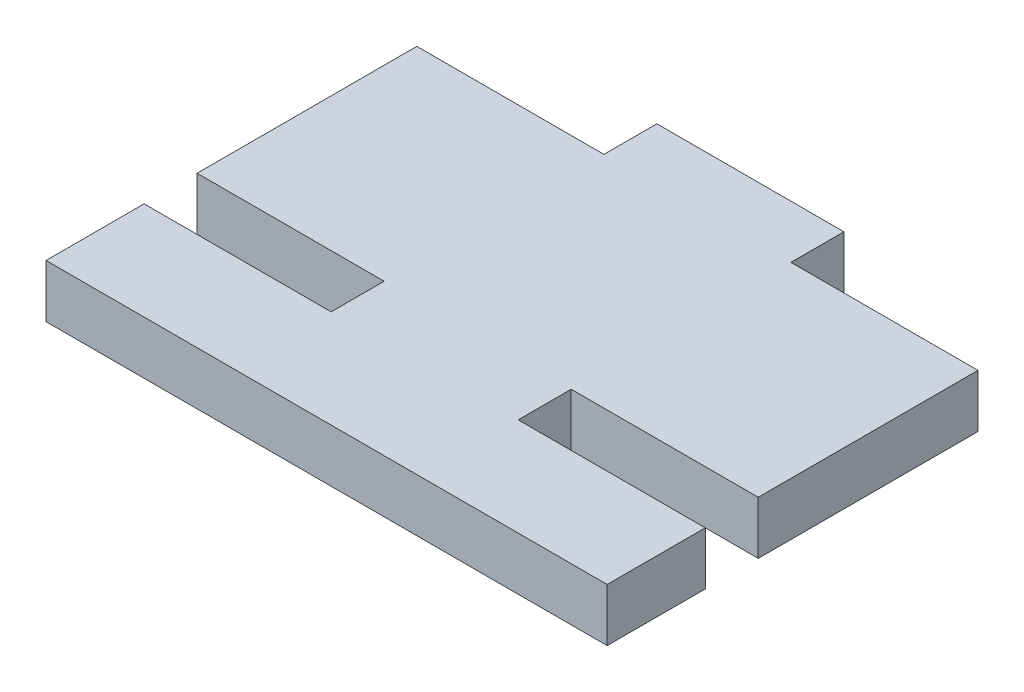
ISO-10303-21;
HEADER;
FILE_DESCRIPTION(('STEP AP214'),'2;1');
FILE_NAME('part.step','',(''),(''),'','','');
FILE_SCHEMA(('AUTOMOTIVE_DESIGN { 1 0 10303 214 1 1 1 1 }'));
ENDSEC;
DATA;
#1=APPLICATION_CONTEXT('core data for automotive mechanical design processes');
#2=APPLICATION_PROTOCOL_DEFINITION('international standard','automotive_design',2000,#1);
#3=PRODUCT_CONTEXT('',#1,'mechanical');
#4=PRODUCT('Part','Part','',(#3));
#5=PRODUCT_RELATED_PRODUCT_CATEGORY('part','',(#4));
#6=PRODUCT_DEFINITION_FORMATION('','',#4);
#7=PRODUCT_DEFINITION_CONTEXT('part definition',#1,'design');
#8=PRODUCT_DEFINITION('design','',#6,#7);
#9=PRODUCT_DEFINITION_SHAPE('','',#8);
#10=(LENGTH_UNIT() NAMED_UNIT(*) SI_UNIT(.MILLI.,.METRE.));
#11=(NAMED_UNIT(*) PLANE_ANGLE_UNIT() SI_UNIT($,.RADIAN.));
#12=(NAMED_UNIT(*) SI_UNIT($,.STERADIAN.) SOLID_ANGLE_UNIT());
#13=UNCERTAINTY_MEASURE_WITH_UNIT(LENGTH_MEASURE(1.E-05),#10,'distance_accuracy_value','');
#14=(GEOMETRIC_REPRESENTATION_CONTEXT(3) GLOBAL_UNCERTAINTY_ASSIGNED_CONTEXT((#13)) GLOBAL_UNIT_ASSIGNED_CONTEXT((#10,
#11,#12)) REPRESENTATION_CONTEXT('',''));
#15=CARTESIAN_POINT('',(0.,0.,0.));
#16=DIRECTION('',(0.,0.,1.));
#17=DIRECTION('',(1.,0.,0.));
#18=AXIS2_PLACEMENT_3D('',#15,#16,#17);
#19=CARTESIAN_POINT('',(14.3,2.7,6.95));
#20=DIRECTION('',(-1.,0.,0.));
#21=DIRECTION('',(0.,0.,1.));
#22=AXIS2_PLACEMENT_3D('',#19,#20,#21);
#23=PLANE('',#22);
#24=DIRECTION('',(0.,0.,-1.));
#25=VECTOR('',#24,1.);
#26=CARTESIAN_POINT('',(14.3,0.,6.95));
#27=LINE('',#26,#25);
#28=CARTESIAN_POINT('',(14.3,0.,11.95));
#29=VERTEX_POINT('',#28);
#30=CARTESIAN_POINT('',(14.3,0.,6.95));
#31=VERTEX_POINT('',#30);
#32=EDGE_CURVE('E177',#29,#31,#27,.T.);
#33=ORIENTED_EDGE('',*,*,#32,.T.);
#34=DIRECTION('',(0.,-1.,0.));
#35=VECTOR('',#34,1.);
#36=CARTESIAN_POINT('',(14.3,2.7,6.95));
#37=LINE('',#36,#35);
#38=CARTESIAN_POINT('',(14.3,2.7,6.95));
#39=VERTEX_POINT('',#38);
#40=EDGE_CURVE('E11',#39,#31,#37,.T.);
#41=ORIENTED_EDGE('',*,*,#40,.F.);
#42=DIRECTION('',(0.,0.,-1.));
#43=VECTOR('',#42,1.);
#44=CARTESIAN_POINT('',(14.3,2.7,6.95));
#45=LINE('',#44,#43);
#46=CARTESIAN_POINT('',(14.3,2.7,11.95));
#47=VERTEX_POINT('',#46);
#48=EDGE_CURVE('E207',#47,#39,#45,.T.);
#49=ORIENTED_EDGE('',*,*,#48,.F.);
#50=DIRECTION('',(0.,-1.,0.));
#51=VECTOR('',#50,1.);
#52=CARTESIAN_POINT('',(14.3,2.7,11.95));
#53=LINE('',#52,#51);
#54=EDGE_CURVE('E173',#47,#29,#53,.T.);
#55=ORIENTED_EDGE('',*,*,#54,.T.);
#56=EDGE_LOOP('',(#33,#41,#49,#55));
#57=FACE_BOUND('',#56,.T.);
#58=ADVANCED_FACE('F33',(#57),#23,.F.);
#59=CARTESIAN_POINT('',(4.76666666666666,2.7,6.95));
#60=DIRECTION('',(0.,0.,1.));
#61=DIRECTION('',(1.,0.,0.));
#62=AXIS2_PLACEMENT_3D('',#59,#60,#61);
#63=PLANE('',#62);
#64=DIRECTION('',(-1.,0.,0.));
#65=VECTOR('',#64,1.);
#66=CARTESIAN_POINT('',(4.76666666666666,0.,6.95));
#67=LINE('',#66,#65);
#68=CARTESIAN_POINT('',(4.76666666666666,0.,6.95));
#69=VERTEX_POINT('',#68);
#70=EDGE_CURVE('E180',#31,#69,#67,.T.);
#71=ORIENTED_EDGE('',*,*,#70,.T.);
#72=DIRECTION('',(0.,-1.,0.));
#73=VECTOR('',#72,1.);
#74=CARTESIAN_POINT('',(4.76666666666666,2.7,6.95));
#75=LINE('',#74,#73);
#76=CARTESIAN_POINT('',(4.76666666666666,2.7,6.95));
#77=VERTEX_POINT('',#76);
#78=EDGE_CURVE('E41',#77,#69,#75,.T.);
#79=ORIENTED_EDGE('',*,*,#78,.F.);
#80=DIRECTION('',(-1.,0.,0.));
#81=VECTOR('',#80,1.);
#82=CARTESIAN_POINT('',(4.76666666666666,2.7,6.95));
#83=LINE('',#82,#81);
#84=EDGE_CURVE('E116',#39,#77,#83,.T.);
#85=ORIENTED_EDGE('',*,*,#84,.F.);
#86=ORIENTED_EDGE('',*,*,#40,.T.);
#87=EDGE_LOOP('',(#71,#79,#85,#86));
#88=FACE_BOUND('',#87,.T.);
#89=ADVANCED_FACE('F305',(#88),#63,.F.);
#90=CARTESIAN_POINT('',(4.76666666666666,2.7,4.25));
#91=DIRECTION('',(-1.,0.,0.));
#92=DIRECTION('',(0.,0.,1.));
#93=AXIS2_PLACEMENT_3D('',#90,#91,#92);
#94=PLANE('',#93);
#95=DIRECTION('',(0.,0.,-1.));
#96=VECTOR('',#95,1.);
#97=CARTESIAN_POINT('',(4.76666666666666,0.,4.25));
#98=LINE('',#97,#96);
#99=CARTESIAN_POINT('',(4.76666666666666,0.,4.25));
#100=VERTEX_POINT('',#99);
#101=EDGE_CURVE('E182',#69,#100,#98,.T.);
#102=ORIENTED_EDGE('',*,*,#101,.T.);
#103=DIRECTION('',(0.,-1.,0.));
#104=VECTOR('',#103,1.);
#105=CARTESIAN_POINT('',(4.76666666666666,2.7,4.25));
#106=LINE('',#105,#104);
#107=CARTESIAN_POINT('',(4.76666666666666,2.7,4.25));
#108=VERTEX_POINT('',#107);
#109=EDGE_CURVE('E238',#108,#100,#106,.T.);
#110=ORIENTED_EDGE('',*,*,#109,.F.);
#111=DIRECTION('',(0.,0.,-1.));
#112=VECTOR('',#111,1.);
#113=CARTESIAN_POINT('',(4.76666666666666,2.7,4.25));
#114=LINE('',#113,#112);
#115=EDGE_CURVE('E246',#77,#108,#114,.T.);
#116=ORIENTED_EDGE('',*,*,#115,.F.);
#117=ORIENTED_EDGE('',*,*,#78,.T.);
#118=EDGE_LOOP('',(#102,#110,#116,#117));
#119=FACE_BOUND('',#118,.T.);
#120=ADVANCED_FACE('F244',(#119),#94,.F.);
#121=CARTESIAN_POINT('',(4.76666666666666,2.7,4.25));
#122=DIRECTION('',(0.,0.,-1.));
#123=DIRECTION('',(-1.,0.,0.));
#124=AXIS2_PLACEMENT_3D('',#121,#122,#123);
#125=PLANE('',#124);
#126=DIRECTION('',(1.,0.,0.));
#127=VECTOR('',#126,1.);
#128=CARTESIAN_POINT('',(4.76666666666666,0.,4.25));
#129=LINE('',#128,#127);
#130=CARTESIAN_POINT('',(14.3,0.,4.25));
#131=VERTEX_POINT('',#130);
#132=EDGE_CURVE('E184',#100,#131,#129,.T.);
#133=ORIENTED_EDGE('',*,*,#132,.T.);
#134=DIRECTION('',(0.,-1.,0.));
#135=VECTOR('',#134,1.);
#136=CARTESIAN_POINT('',(14.3,2.7,4.25));
#137=LINE('',#136,#135);
#138=CARTESIAN_POINT('',(14.3,2.7,4.25));
#139=VERTEX_POINT('',#138);
#140=EDGE_CURVE('E235',#139,#131,#137,.T.);
#141=ORIENTED_EDGE('',*,*,#140,.F.);
#142=DIRECTION('',(1.,0.,0.));
#143=VECTOR('',#142,1.);
#144=CARTESIAN_POINT('',(4.76666666666666,2.7,4.25));
#145=LINE('',#144,#143);
#146=EDGE_CURVE('E264',#108,#139,#145,.T.);
#147=ORIENTED_EDGE('',*,*,#146,.F.);
#148=ORIENTED_EDGE('',*,*,#109,.T.);
#149=EDGE_LOOP('',(#133,#141,#147,#148));
#150=FACE_BOUND('',#149,.T.);
#151=ADVANCED_FACE('F255',(#150),#125,.F.);
#152=CARTESIAN_POINT('',(14.3,2.7,-6.95));
#153=DIRECTION('',(-1.,0.,0.));
#154=DIRECTION('',(0.,0.,1.));
#155=AXIS2_PLACEMENT_3D('',#152,#153,#154);
#156=PLANE('',#155);
#157=DIRECTION('',(0.,0.,-1.));
#158=VECTOR('',#157,1.);
#159=CARTESIAN_POINT('',(14.3,0.,-6.95));
#160=LINE('',#159,#158);
#161=CARTESIAN_POINT('',(14.3,0.,-6.95));
#162=VERTEX_POINT('',#161);
#163=EDGE_CURVE('E186',#131,#162,#160,.T.);
#164=ORIENTED_EDGE('',*,*,#163,.T.);
#165=DIRECTION('',(0.,-1.,0.));
#166=VECTOR('',#165,1.);
#167=CARTESIAN_POINT('',(14.3,2.7,-6.95));
#168=LINE('',#167,#166);
#169=CARTESIAN_POINT('',(14.3,2.7,-6.95));
#170=VERTEX_POINT('',#169);
#171=EDGE_CURVE('E232',#170,#162,#168,.T.);
#172=ORIENTED_EDGE('',*,*,#171,.F.);
#173=DIRECTION('',(0.,0.,-1.));
#174=VECTOR('',#173,1.);
#175=CARTESIAN_POINT('',(14.3,2.7,-6.95));
#176=LINE('',#175,#174);
#177=EDGE_CURVE('E261',#139,#170,#176,.T.);
#178=ORIENTED_EDGE('',*,*,#177,.F.);
#179=ORIENTED_EDGE('',*,*,#140,.T.);
#180=EDGE_LOOP('',(#164,#172,#178,#179));
#181=FACE_BOUND('',#180,.T.);
#182=ADVANCED_FACE('F259',(#181),#156,.F.);
#183=CARTESIAN_POINT('',(4.76666666666666,2.7,-6.95));
#184=DIRECTION('',(0.,0.,1.));
#185=DIRECTION('',(1.,0.,0.));
#186=AXIS2_PLACEMENT_3D('',#183,#184,#185);
#187=PLANE('',#186);
#188=DIRECTION('',(-1.,0.,0.));
#189=VECTOR('',#188,1.);
#190=CARTESIAN_POINT('',(4.76666666666666,0.,-6.95));
#191=LINE('',#190,#189);
#192=CARTESIAN_POINT('',(4.76666666666666,0.,-6.95));
#193=VERTEX_POINT('',#192);
#194=EDGE_CURVE('E188',#162,#193,#191,.T.);
#195=ORIENTED_EDGE('',*,*,#194,.T.);
#196=DIRECTION('',(0.,-1.,0.));
#197=VECTOR('',#196,1.);
#198=CARTESIAN_POINT('',(4.76666666666666,2.7,-6.95));
#199=LINE('',#198,#197);
#200=CARTESIAN_POINT('',(4.76666666666666,2.7,-6.95));
#201=VERTEX_POINT('',#200);
#202=EDGE_CURVE('E229',#201,#193,#199,.T.);
#203=ORIENTED_EDGE('',*,*,#202,.F.);
#204=DIRECTION('',(-1.,0.,0.));
#205=VECTOR('',#204,1.);
#206=CARTESIAN_POINT('',(4.76666666666666,2.7,-6.95));
#207=LINE('',#206,#205);
#208=EDGE_CURVE('E263',#170,#201,#207,.T.);
#209=ORIENTED_EDGE('',*,*,#208,.F.);
#210=ORIENTED_EDGE('',*,*,#171,.T.);
#211=EDGE_LOOP('',(#195,#203,#209,#210));
#212=FACE_BOUND('',#211,.T.);
#213=ADVANCED_FACE('F318',(#212),#187,.F.);
#214=CARTESIAN_POINT('',(4.76666666666666,2.7,-6.95));
#215=DIRECTION('',(-1.,0.,0.));
#216=DIRECTION('',(0.,0.,1.));
#217=AXIS2_PLACEMENT_3D('',#214,#215,#216);
#218=PLANE('',#217);
#219=DIRECTION('',(0.,0.,-1.));
#220=VECTOR('',#219,1.);
#221=CARTESIAN_POINT('',(4.76666666666666,0.,-6.95));
#222=LINE('',#221,#220);
#223=CARTESIAN_POINT('',(4.76666666666666,0.,-9.65));
#224=VERTEX_POINT('',#223);
#225=EDGE_CURVE('E190',#193,#224,#222,.T.);
#226=ORIENTED_EDGE('',*,*,#225,.T.);
#227=DIRECTION('',(0.,-1.,0.));
#228=VECTOR('',#227,1.);
#229=CARTESIAN_POINT('',(4.76666666666666,2.7,-9.65));
#230=LINE('',#229,#228);
#231=CARTESIAN_POINT('',(4.76666666666666,2.7,-9.65));
#232=VERTEX_POINT('',#231);
#233=EDGE_CURVE('E226',#232,#224,#230,.T.);
#234=ORIENTED_EDGE('',*,*,#233,.F.);
#235=DIRECTION('',(0.,0.,-1.));
#236=VECTOR('',#235,1.);
#237=CARTESIAN_POINT('',(4.76666666666666,2.7,-6.95));
#238=LINE('',#237,#236);
#239=EDGE_CURVE('E266',#201,#232,#238,.T.);
#240=ORIENTED_EDGE('',*,*,#239,.F.);
#241=ORIENTED_EDGE('',*,*,#202,.T.);
#242=EDGE_LOOP('',(#226,#234,#240,#241));
#243=FACE_BOUND('',#242,.T.);
#244=ADVANCED_FACE('F321',(#243),#218,.F.);
#245=CARTESIAN_POINT('',(-4.76666666666667,2.7,-9.65));
#246=DIRECTION('',(0.,0.,1.));
#247=DIRECTION('',(1.,0.,0.));
#248=AXIS2_PLACEMENT_3D('',#245,#246,#247);
#249=PLANE('',#248);
#250=DIRECTION('',(-1.,0.,0.));
#251=VECTOR('',#250,1.);
#252=CARTESIAN_POINT('',(-4.76666666666667,0.,-9.65));
#253=LINE('',#252,#251);
#254=CARTESIAN_POINT('',(-4.76666666666667,0.,-9.65));
#255=VERTEX_POINT('',#254);
#256=EDGE_CURVE('E192',#224,#255,#253,.T.);
#257=ORIENTED_EDGE('',*,*,#256,.T.);
#258=DIRECTION('',(0.,-1.,0.));
#259=VECTOR('',#258,1.);
#260=CARTESIAN_POINT('',(-4.76666666666667,2.7,-9.65));
#261=LINE('',#260,#259);
#262=CARTESIAN_POINT('',(-4.76666666666667,2.7,-9.65));
#263=VERTEX_POINT('',#262);
#264=EDGE_CURVE('E223',#263,#255,#261,.T.);
#265=ORIENTED_EDGE('',*,*,#264,.F.);
#266=DIRECTION('',(-1.,0.,0.));
#267=VECTOR('',#266,1.);
#268=CARTESIAN_POINT('',(-4.76666666666667,2.7,-9.65));
#269=LINE('',#268,#267);
#270=EDGE_CURVE('E272',#232,#263,#269,.T.);
#271=ORIENTED_EDGE('',*,*,#270,.F.);
#272=ORIENTED_EDGE('',*,*,#233,.T.);
#273=EDGE_LOOP('',(#257,#265,#271,#272));
#274=FACE_BOUND('',#273,.T.);
#275=ADVANCED_FACE('F325',(#274),#249,.F.);
#276=CARTESIAN_POINT('',(-4.76666666666667,2.7,-6.95));
#277=DIRECTION('',(1.,0.,0.));
#278=DIRECTION('',(0.,0.,-1.));
#279=AXIS2_PLACEMENT_3D('',#276,#277,#278);
#280=PLANE('',#279);
#281=DIRECTION('',(0.,0.,1.));
#282=VECTOR('',#281,1.);
#283=CARTESIAN_POINT('',(-4.76666666666667,0.,-6.95));
#284=LINE('',#283,#282);
#285=CARTESIAN_POINT('',(-4.76666666666667,0.,-6.95));
#286=VERTEX_POINT('',#285);
#287=EDGE_CURVE('E194',#255,#286,#284,.T.);
#288=ORIENTED_EDGE('',*,*,#287,.T.);
#289=DIRECTION('',(0.,-1.,0.));
#290=VECTOR('',#289,1.);
#291=CARTESIAN_POINT('',(-4.76666666666667,2.7,-6.95));
#292=LINE('',#291,#290);
#293=CARTESIAN_POINT('',(-4.76666666666667,2.7,-6.95));
#294=VERTEX_POINT('',#293);
#295=EDGE_CURVE('E220',#294,#286,#292,.T.);
#296=ORIENTED_EDGE('',*,*,#295,.F.);
#297=DIRECTION('',(0.,0.,1.));
#298=VECTOR('',#297,1.);
#299=CARTESIAN_POINT('',(-4.76666666666667,2.7,-6.95));
#300=LINE('',#299,#298);
#301=EDGE_CURVE('E274',#263,#294,#300,.T.);
#302=ORIENTED_EDGE('',*,*,#301,.F.);
#303=ORIENTED_EDGE('',*,*,#264,.T.);
#304=EDGE_LOOP('',(#288,#296,#302,#303));
#305=FACE_BOUND('',#304,.T.);
#306=ADVANCED_FACE('F329',(#305),#280,.F.);
#307=CARTESIAN_POINT('',(-14.3,2.7,-6.95));
#308=DIRECTION('',(0.,0.,1.));
#309=DIRECTION('',(1.,0.,0.));
#310=AXIS2_PLACEMENT_3D('',#307,#308,#309);
#311=PLANE('',#310);
#312=DIRECTION('',(-1.,0.,0.));
#313=VECTOR('',#312,1.);
#314=CARTESIAN_POINT('',(-14.3,0.,-6.95));
#315=LINE('',#314,#313);
#316=CARTESIAN_POINT('',(-14.3,0.,-6.95));
#317=VERTEX_POINT('',#316);
#318=EDGE_CURVE('E196',#286,#317,#315,.T.);
#319=ORIENTED_EDGE('',*,*,#318,.T.);
#320=DIRECTION('',(0.,-1.,0.));
#321=VECTOR('',#320,1.);
#322=CARTESIAN_POINT('',(-14.3,2.7,-6.95));
#323=LINE('',#322,#321);
#324=CARTESIAN_POINT('',(-14.3,2.7,-6.95));
#325=VERTEX_POINT('',#324);
#326=EDGE_CURVE('E217',#325,#317,#323,.T.);
#327=ORIENTED_EDGE('',*,*,#326,.F.);
#328=DIRECTION('',(-1.,0.,0.));
#329=VECTOR('',#328,1.);
#330=CARTESIAN_POINT('',(-14.3,2.7,-6.95));
#331=LINE('',#330,#329);
#332=EDGE_CURVE('E276',#294,#325,#331,.T.);
#333=ORIENTED_EDGE('',*,*,#332,.F.);
#334=ORIENTED_EDGE('',*,*,#295,.T.);
#335=EDGE_LOOP('',(#319,#327,#333,#334));
#336=FACE_BOUND('',#335,.T.);
#337=ADVANCED_FACE('F333',(#336),#311,.F.);
#338=CARTESIAN_POINT('',(-14.3,2.7,-6.95));
#339=DIRECTION('',(1.,0.,0.));
#340=DIRECTION('',(0.,0.,-1.));
#341=AXIS2_PLACEMENT_3D('',#338,#339,#340);
#342=PLANE('',#341);
#343=DIRECTION('',(0.,0.,1.));
#344=VECTOR('',#343,1.);
#345=CARTESIAN_POINT('',(-14.3,0.,-6.95));
#346=LINE('',#345,#344);
#347=CARTESIAN_POINT('',(-14.3,0.,4.25));
#348=VERTEX_POINT('',#347);
#349=EDGE_CURVE('E198',#317,#348,#346,.T.);
#350=ORIENTED_EDGE('',*,*,#349,.T.);
#351=DIRECTION('',(0.,-1.,0.));
#352=VECTOR('',#351,1.);
#353=CARTESIAN_POINT('',(-14.3,2.7,4.25));
#354=LINE('',#353,#352);
#355=CARTESIAN_POINT('',(-14.3,2.7,4.25));
#356=VERTEX_POINT('',#355);
#357=EDGE_CURVE('E214',#356,#348,#354,.T.);
#358=ORIENTED_EDGE('',*,*,#357,.F.);
#359=DIRECTION('',(0.,0.,1.));
#360=VECTOR('',#359,1.);
#361=CARTESIAN_POINT('',(-14.3,2.7,-6.95));
#362=LINE('',#361,#360);
#363=EDGE_CURVE('E278',#325,#356,#362,.T.);
#364=ORIENTED_EDGE('',*,*,#363,.F.);
#365=ORIENTED_EDGE('',*,*,#326,.T.);
#366=EDGE_LOOP('',(#350,#358,#364,#365));
#367=FACE_BOUND('',#366,.T.);
#368=ADVANCED_FACE('F337',(#367),#342,.F.);
#369=CARTESIAN_POINT('',(-14.3,2.7,4.25));
#370=DIRECTION('',(0.,0.,-1.));
#371=DIRECTION('',(-1.,0.,0.));
#372=AXIS2_PLACEMENT_3D('',#369,#370,#371);
#373=PLANE('',#372);
#374=DIRECTION('',(1.,0.,0.));
#375=VECTOR('',#374,1.);
#376=CARTESIAN_POINT('',(-14.3,0.,4.25));
#377=LINE('',#376,#375);
#378=CARTESIAN_POINT('',(-4.76666666666667,0.,4.25));
#379=VERTEX_POINT('',#378);
#380=EDGE_CURVE('E200',#348,#379,#377,.T.);
#381=ORIENTED_EDGE('',*,*,#380,.T.);
#382=DIRECTION('',(0.,-1.,0.));
#383=VECTOR('',#382,1.);
#384=CARTESIAN_POINT('',(-4.76666666666667,2.7,4.25));
#385=LINE('',#384,#383);
#386=CARTESIAN_POINT('',(-4.76666666666667,2.7,4.25));
#387=VERTEX_POINT('',#386);
#388=EDGE_CURVE('E211',#387,#379,#385,.T.);
#389=ORIENTED_EDGE('',*,*,#388,.F.);
#390=DIRECTION('',(1.,0.,0.));
#391=VECTOR('',#390,1.);
#392=CARTESIAN_POINT('',(-14.3,2.7,4.25));
#393=LINE('',#392,#391);
#394=EDGE_CURVE('E280',#356,#387,#393,.T.);
#395=ORIENTED_EDGE('',*,*,#394,.F.);
#396=ORIENTED_EDGE('',*,*,#357,.T.);
#397=EDGE_LOOP('',(#381,#389,#395,#396));
#398=FACE_BOUND('',#397,.T.);
#399=ADVANCED_FACE('F286',(#398),#373,.F.);
#400=CARTESIAN_POINT('',(-4.76666666666667,2.7,4.25));
#401=DIRECTION('',(1.,0.,0.));
#402=DIRECTION('',(0.,0.,-1.));
#403=AXIS2_PLACEMENT_3D('',#400,#401,#402);
#404=PLANE('',#403);
#405=DIRECTION('',(0.,0.,1.));
#406=VECTOR('',#405,1.);
#407=CARTESIAN_POINT('',(-4.76666666666667,0.,4.25));
#408=LINE('',#407,#406);
#409=CARTESIAN_POINT('',(-4.76666666666667,0.,6.95));
#410=VERTEX_POINT('',#409);
#411=EDGE_CURVE('E202',#379,#410,#408,.T.);
#412=ORIENTED_EDGE('',*,*,#411,.T.);
#413=DIRECTION('',(0.,-1.,0.));
#414=VECTOR('',#413,1.);
#415=CARTESIAN_POINT('',(-4.76666666666667,2.7,6.95));
#416=LINE('',#415,#414);
#417=CARTESIAN_POINT('',(-4.76666666666667,2.7,6.95));
#418=VERTEX_POINT('',#417);
#419=EDGE_CURVE('E168',#418,#410,#416,.T.);
#420=ORIENTED_EDGE('',*,*,#419,.F.);
#421=DIRECTION('',(0.,0.,1.));
#422=VECTOR('',#421,1.);
#423=CARTESIAN_POINT('',(-4.76666666666667,2.7,4.25));
#424=LINE('',#423,#422);
#425=EDGE_CURVE('E159',#387,#418,#424,.T.);
#426=ORIENTED_EDGE('',*,*,#425,.F.);
#427=ORIENTED_EDGE('',*,*,#388,.T.);
#428=EDGE_LOOP('',(#412,#420,#426,#427));
#429=FACE_BOUND('',#428,.T.);
#430=ADVANCED_FACE('F290',(#429),#404,.F.);
#431=CARTESIAN_POINT('',(-14.3,2.7,6.95));
#432=DIRECTION('',(0.,0.,1.));
#433=DIRECTION('',(1.,0.,0.));
#434=AXIS2_PLACEMENT_3D('',#431,#432,#433);
#435=PLANE('',#434);
#436=DIRECTION('',(-1.,0.,0.));
#437=VECTOR('',#436,1.);
#438=CARTESIAN_POINT('',(-14.3,0.,6.95));
#439=LINE('',#438,#437);
#440=CARTESIAN_POINT('',(-14.3,0.,6.95));
#441=VERTEX_POINT('',#440);
#442=EDGE_CURVE('E167',#410,#441,#439,.T.);
#443=ORIENTED_EDGE('',*,*,#442,.T.);
#444=DIRECTION('',(0.,-1.,0.));
#445=VECTOR('',#444,1.);
#446=CARTESIAN_POINT('',(-14.3,2.7,6.95));
#447=LINE('',#446,#445);
#448=CARTESIAN_POINT('',(-14.3,2.7,6.95));
#449=VERTEX_POINT('',#448);
#450=EDGE_CURVE('E164',#449,#441,#447,.T.);
#451=ORIENTED_EDGE('',*,*,#450,.F.);
#452=DIRECTION('',(-1.,0.,0.));
#453=VECTOR('',#452,1.);
#454=CARTESIAN_POINT('',(-14.3,2.7,6.95));
#455=LINE('',#454,#453);
#456=EDGE_CURVE('E153',#418,#449,#455,.T.);
#457=ORIENTED_EDGE('',*,*,#456,.F.);
#458=ORIENTED_EDGE('',*,*,#419,.T.);
#459=EDGE_LOOP('',(#443,#451,#457,#458));
#460=FACE_BOUND('',#459,.T.);
#461=ADVANCED_FACE('F165',(#460),#435,.F.);
#462=CARTESIAN_POINT('',(-14.3,2.7,6.95));
#463=DIRECTION('',(1.,0.,0.));
#464=DIRECTION('',(0.,0.,-1.));
#465=AXIS2_PLACEMENT_3D('',#462,#463,#464);
#466=PLANE('',#465);
#467=DIRECTION('',(0.,0.,1.));
#468=VECTOR('',#467,1.);
#469=CARTESIAN_POINT('',(-14.3,0.,6.95));
#470=LINE('',#469,#468);
#471=CARTESIAN_POINT('',(-14.3,0.,11.95));
#472=VERTEX_POINT('',#471);
#473=EDGE_CURVE('E102',#441,#472,#470,.T.);
#474=ORIENTED_EDGE('',*,*,#473,.T.);
#475=DIRECTION('',(0.,-1.,0.));
#476=VECTOR('',#475,1.);
#477=CARTESIAN_POINT('',(-14.3,2.7,11.95));
#478=LINE('',#477,#476);
#479=CARTESIAN_POINT('',(-14.3,2.7,11.95));
#480=VERTEX_POINT('',#479);
#481=EDGE_CURVE('E169',#480,#472,#478,.T.);
#482=ORIENTED_EDGE('',*,*,#481,.F.);
#483=DIRECTION('',(0.,0.,1.));
#484=VECTOR('',#483,1.);
#485=CARTESIAN_POINT('',(-14.3,2.7,6.95));
#486=LINE('',#485,#484);
#487=EDGE_CURVE('E157',#449,#480,#486,.T.);
#488=ORIENTED_EDGE('',*,*,#487,.F.);
#489=ORIENTED_EDGE('',*,*,#450,.T.);
#490=EDGE_LOOP('',(#474,#482,#488,#489));
#491=FACE_BOUND('',#490,.T.);
#492=ADVANCED_FACE('F171',(#491),#466,.F.);
#493=CARTESIAN_POINT('',(-14.3,2.7,11.95));
#494=DIRECTION('',(0.,0.,-1.));
#495=DIRECTION('',(-1.,0.,0.));
#496=AXIS2_PLACEMENT_3D('',#493,#494,#495);
#497=PLANE('',#496);
#498=DIRECTION('',(1.,0.,0.));
#499=VECTOR('',#498,1.);
#500=CARTESIAN_POINT('',(-14.3,0.,11.95));
#501=LINE('',#500,#499);
#502=EDGE_CURVE('E108',#472,#29,#501,.T.);
#503=ORIENTED_EDGE('',*,*,#502,.T.);
#504=ORIENTED_EDGE('',*,*,#54,.F.);
#505=DIRECTION('',(1.,0.,0.));
#506=VECTOR('',#505,1.);
#507=CARTESIAN_POINT('',(-14.3,2.7,11.95));
#508=LINE('',#507,#506);
#509=EDGE_CURVE('E49',#480,#47,#508,.T.);
#510=ORIENTED_EDGE('',*,*,#509,.F.);
#511=ORIENTED_EDGE('',*,*,#481,.T.);
#512=EDGE_LOOP('',(#503,#504,#510,#511));
#513=FACE_BOUND('',#512,.T.);
#514=ADVANCED_FACE('F294',(#513),#497,.F.);
#515=CARTESIAN_POINT('',(0.,2.7,0.));
#516=DIRECTION('',(0.,1.,0.));
#517=DIRECTION('',(0.,0.,1.));
#518=AXIS2_PLACEMENT_3D('',#515,#516,#517);
#519=PLANE('',#518);
#520=ORIENTED_EDGE('',*,*,#48,.T.);
#521=ORIENTED_EDGE('',*,*,#84,.T.);
#522=ORIENTED_EDGE('',*,*,#115,.T.);
#523=ORIENTED_EDGE('',*,*,#146,.T.);
#524=ORIENTED_EDGE('',*,*,#177,.T.);
#525=ORIENTED_EDGE('',*,*,#208,.T.);
#526=ORIENTED_EDGE('',*,*,#239,.T.);
#527=ORIENTED_EDGE('',*,*,#270,.T.);
#528=ORIENTED_EDGE('',*,*,#301,.T.);
#529=ORIENTED_EDGE('',*,*,#332,.T.);
#530=ORIENTED_EDGE('',*,*,#363,.T.);
#531=ORIENTED_EDGE('',*,*,#394,.T.);
#532=ORIENTED_EDGE('',*,*,#425,.T.);
#533=ORIENTED_EDGE('',*,*,#456,.T.);
#534=ORIENTED_EDGE('',*,*,#487,.T.);
#535=ORIENTED_EDGE('',*,*,#509,.T.);
#536=EDGE_LOOP('',(#520,#521,#522,#523,#524,#525,#526,#527,#528,#529,#530,#531,#532,#533,#534,#535));
#537=FACE_BOUND('',#536,.T.);
#538=ADVANCED_FACE('F155',(#537),#519,.T.);
#539=CARTESIAN_POINT('',(0.,0.,0.));
#540=DIRECTION('',(0.,1.,0.));
#541=DIRECTION('',(0.,0.,1.));
#542=AXIS2_PLACEMENT_3D('',#539,#540,#541);
#543=PLANE('',#542);
#544=ORIENTED_EDGE('',*,*,#32,.F.);
#545=ORIENTED_EDGE('',*,*,#502,.F.);
#546=ORIENTED_EDGE('',*,*,#473,.F.);
#547=ORIENTED_EDGE('',*,*,#442,.F.);
#548=ORIENTED_EDGE('',*,*,#411,.F.);
#549=ORIENTED_EDGE('',*,*,#380,.F.);
#550=ORIENTED_EDGE('',*,*,#349,.F.);
#551=ORIENTED_EDGE('',*,*,#318,.F.);
#552=ORIENTED_EDGE('',*,*,#287,.F.);
#553=ORIENTED_EDGE('',*,*,#256,.F.);
#554=ORIENTED_EDGE('',*,*,#225,.F.);
#555=ORIENTED_EDGE('',*,*,#194,.F.);
#556=ORIENTED_EDGE('',*,*,#163,.F.);
#557=ORIENTED_EDGE('',*,*,#132,.F.);
#558=ORIENTED_EDGE('',*,*,#101,.F.);
#559=ORIENTED_EDGE('',*,*,#70,.F.);
#560=EDGE_LOOP('',(#544,#545,#546,#547,#548,#549,#550,#551,#552,#553,#554,#555,#556,#557,#558,#559));
#561=FACE_BOUND('',#560,.T.);
#562=ADVANCED_FACE('F250',(#561),#543,.F.);
#563=CLOSED_SHELL('',(#58,#89,#120,#151,#182,#213,#244,#275,#306,#337,#368,#399,#430,#461,#492,
#514,#538,#562));
#564=MANIFOLD_SOLID_BREP('B2',#563);
#565=ADVANCED_BREP_SHAPE_REPRESENTATION('',(#18,#564),#14);
#566=SHAPE_DEFINITION_REPRESENTATION(#9,#565);
ENDSEC;
END-ISO-10303-21;
